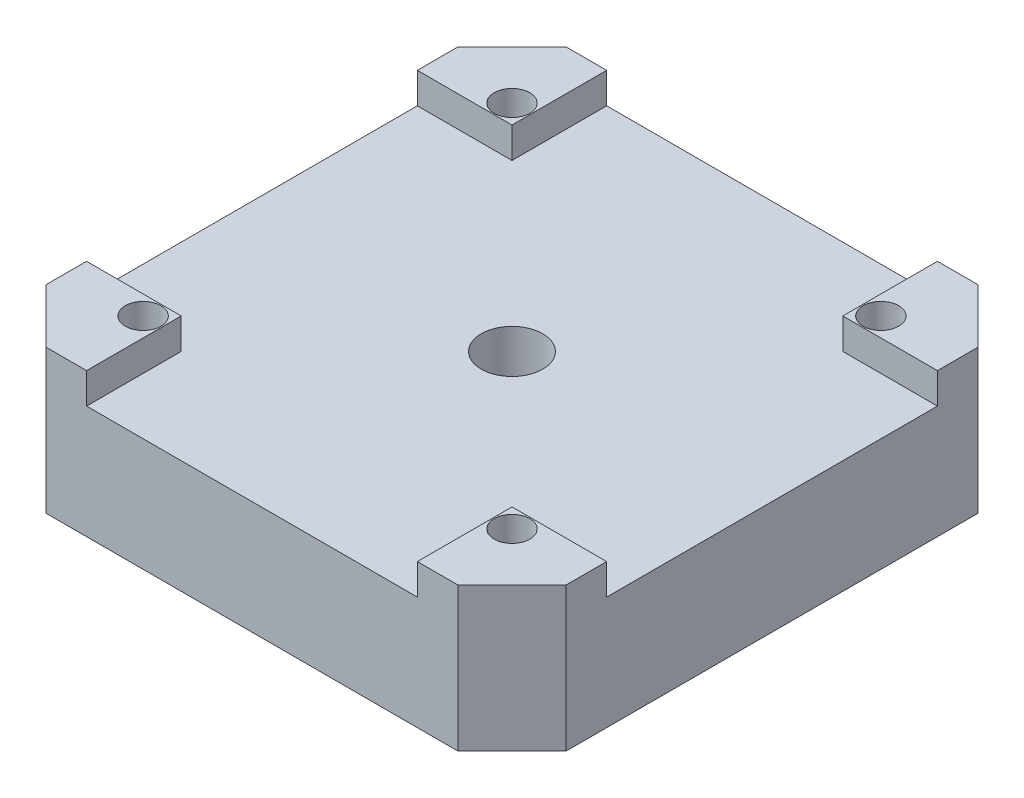
ISO-10303-21;
HEADER;
FILE_DESCRIPTION(('STEP AP214'),'2;1');
FILE_NAME('part.step','',(''),(''),'','','');
FILE_SCHEMA(('AUTOMOTIVE_DESIGN { 1 0 10303 214 1 1 1 1 }'));
ENDSEC;
DATA;
#1=APPLICATION_CONTEXT('core data for automotive mechanical design processes');
#2=APPLICATION_PROTOCOL_DEFINITION('international standard','automotive_design',2000,#1);
#3=PRODUCT_CONTEXT('',#1,'mechanical');
#4=PRODUCT('Part','Part','',(#3));
#5=PRODUCT_RELATED_PRODUCT_CATEGORY('part','',(#4));
#6=PRODUCT_DEFINITION_FORMATION('','',#4);
#7=PRODUCT_DEFINITION_CONTEXT('part definition',#1,'design');
#8=PRODUCT_DEFINITION('design','',#6,#7);
#9=PRODUCT_DEFINITION_SHAPE('','',#8);
#10=(LENGTH_UNIT() NAMED_UNIT(*) SI_UNIT(.MILLI.,.METRE.));
#11=(NAMED_UNIT(*) PLANE_ANGLE_UNIT() SI_UNIT($,.RADIAN.));
#12=(NAMED_UNIT(*) SI_UNIT($,.STERADIAN.) SOLID_ANGLE_UNIT());
#13=UNCERTAINTY_MEASURE_WITH_UNIT(LENGTH_MEASURE(1.E-05),#10,'distance_accuracy_value','');
#14=(GEOMETRIC_REPRESENTATION_CONTEXT(3) GLOBAL_UNCERTAINTY_ASSIGNED_CONTEXT((#13)) GLOBAL_UNIT_ASSIGNED_CONTEXT((#10,
#11,#12)) REPRESENTATION_CONTEXT('',''));
#15=CARTESIAN_POINT('',(0.,0.,0.));
#16=DIRECTION('',(0.,0.,1.));
#17=DIRECTION('',(1.,0.,0.));
#18=AXIS2_PLACEMENT_3D('',#15,#16,#17);
#19=CARTESIAN_POINT('',(0.,11.7,0.));
#20=DIRECTION('',(0.,-1.,0.));
#21=DIRECTION('',(0.,0.,-1.));
#22=AXIS2_PLACEMENT_3D('',#19,#20,#21);
#23=PLANE('',#22);
#24=CARTESIAN_POINT('',(15.,11.7,-15.));
#25=DIRECTION('',(0.,-1.,0.));
#26=DIRECTION('',(0.,0.,-1.));
#27=AXIS2_PLACEMENT_3D('',#24,#25,#26);
#28=CIRCLE('',#27,1.45);
#29=CARTESIAN_POINT('',(15.,11.7,-16.45));
#30=VERTEX_POINT('',#29);
#31=EDGE_CURVE('E371',#30,#30,#28,.T.);
#32=ORIENTED_EDGE('',*,*,#31,.T.);
#33=EDGE_LOOP('',(#32));
#34=FACE_BOUND('',#33,.T.);
#35=DIRECTION('',(-1.,0.,0.));
#36=VECTOR('',#35,1.);
#37=CARTESIAN_POINT('',(-16.750923471599,11.7,-21.15));
#38=LINE('',#37,#36);
#39=CARTESIAN_POINT('',(16.750923471599,11.7,-21.15));
#40=VERTEX_POINT('',#39);
#41=CARTESIAN_POINT('',(13.450923471599,11.7,-21.15));
#42=VERTEX_POINT('',#41);
#43=EDGE_CURVE('E193',#40,#42,#38,.T.);
#44=ORIENTED_EDGE('',*,*,#43,.T.);
#45=DIRECTION('',(0.,0.,1.));
#46=VECTOR('',#45,1.);
#47=CARTESIAN_POINT('',(13.450923471599,11.7,-21.15));
#48=LINE('',#47,#46);
#49=CARTESIAN_POINT('',(13.450923471599,11.7,-13.4509234715989));
#50=VERTEX_POINT('',#49);
#51=EDGE_CURVE('E303',#42,#50,#48,.T.);
#52=ORIENTED_EDGE('',*,*,#51,.T.);
#53=DIRECTION('',(1.,0.,0.));
#54=VECTOR('',#53,1.);
#55=CARTESIAN_POINT('',(-21.15,11.7,-13.4509234715989));
#56=LINE('',#55,#54);
#57=CARTESIAN_POINT('',(21.15,11.7,-13.4509234715989));
#58=VERTEX_POINT('',#57);
#59=EDGE_CURVE('E289',#50,#58,#56,.T.);
#60=ORIENTED_EDGE('',*,*,#59,.T.);
#61=DIRECTION('',(0.,0.,-1.));
#62=VECTOR('',#61,1.);
#63=CARTESIAN_POINT('',(21.15,11.7,16.7509234715989));
#64=LINE('',#63,#62);
#65=CARTESIAN_POINT('',(21.15,11.7,-16.7509234715989));
#66=VERTEX_POINT('',#65);
#67=EDGE_CURVE('E277',#58,#66,#64,.T.);
#68=ORIENTED_EDGE('',*,*,#67,.T.);
#69=DIRECTION('',(-0.707106781186542,0.,-0.707106781186553));
#70=VECTOR('',#69,1.);
#71=CARTESIAN_POINT('',(16.750923471599,11.7,-21.15));
#72=LINE('',#71,#70);
#73=EDGE_CURVE('E194',#66,#40,#72,.T.);
#74=ORIENTED_EDGE('',*,*,#73,.T.);
#75=EDGE_LOOP('',(#44,#52,#60,#68,#74));
#76=FACE_BOUND('',#75,.T.);
#77=ADVANCED_FACE('F34',(#34,#76),#23,.F.);
#78=CARTESIAN_POINT('',(15.,11.7,15.));
#79=DIRECTION('',(0.,-1.,0.));
#80=DIRECTION('',(0.,0.,-1.));
#81=AXIS2_PLACEMENT_3D('',#78,#79,#80);
#82=CIRCLE('',#81,1.45);
#83=CARTESIAN_POINT('',(15.,11.7,13.55));
#84=VERTEX_POINT('',#83);
#85=EDGE_CURVE('E385',#84,#84,#82,.T.);
#86=ORIENTED_EDGE('',*,*,#85,.T.);
#87=EDGE_LOOP('',(#86));
#88=FACE_BOUND('',#87,.T.);
#89=DIRECTION('',(1.,0.,0.));
#90=VECTOR('',#89,1.);
#91=CARTESIAN_POINT('',(-21.15,11.7,13.4509234715989));
#92=LINE('',#91,#90);
#93=CARTESIAN_POINT('',(13.450923471599,11.7,13.4509234715989));
#94=VERTEX_POINT('',#93);
#95=CARTESIAN_POINT('',(21.15,11.7,13.4509234715989));
#96=VERTEX_POINT('',#95);
#97=EDGE_CURVE('E267',#94,#96,#92,.T.);
#98=ORIENTED_EDGE('',*,*,#97,.F.);
#99=CARTESIAN_POINT('',(13.450923471599,11.7,21.15));
#100=VERTEX_POINT('',#99);
#101=EDGE_CURVE('E306',#94,#100,#48,.T.);
#102=ORIENTED_EDGE('',*,*,#101,.T.);
#103=DIRECTION('',(1.,0.,0.));
#104=VECTOR('',#103,1.);
#105=CARTESIAN_POINT('',(-16.750923471599,11.7,21.15));
#106=LINE('',#105,#104);
#107=CARTESIAN_POINT('',(16.750923471599,11.7,21.15));
#108=VERTEX_POINT('',#107);
#109=EDGE_CURVE('E272',#100,#108,#106,.T.);
#110=ORIENTED_EDGE('',*,*,#109,.T.);
#111=DIRECTION('',(0.707106781186546,0.,-0.707106781186549));
#112=VECTOR('',#111,1.);
#113=CARTESIAN_POINT('',(16.750923471599,11.7,21.15));
#114=LINE('',#113,#112);
#115=CARTESIAN_POINT('',(21.15,11.7,16.7509234715989));
#116=VERTEX_POINT('',#115);
#117=EDGE_CURVE('E276',#108,#116,#114,.T.);
#118=ORIENTED_EDGE('',*,*,#117,.T.);
#119=EDGE_CURVE('E199',#116,#96,#64,.T.);
#120=ORIENTED_EDGE('',*,*,#119,.T.);
#121=EDGE_LOOP('',(#98,#102,#110,#118,#120));
#122=FACE_BOUND('',#121,.T.);
#123=ADVANCED_FACE('F447',(#88,#122),#23,.F.);
#124=CARTESIAN_POINT('',(-21.15,9.2,-13.4509234715989));
#125=DIRECTION('',(0.,0.,-1.));
#126=DIRECTION('',(-1.,0.,0.));
#127=AXIS2_PLACEMENT_3D('',#124,#125,#126);
#128=PLANE('',#127);
#129=ORIENTED_EDGE('',*,*,#59,.F.);
#130=DIRECTION('',(0.,-1.,0.));
#131=VECTOR('',#130,1.);
#132=CARTESIAN_POINT('',(13.450923471599,9.20000000000002,-13.4509234715989));
#133=LINE('',#132,#131);
#134=CARTESIAN_POINT('',(13.450923471599,9.2,-13.4509234715989));
#135=VERTEX_POINT('',#134);
#136=EDGE_CURVE('E311',#50,#135,#133,.T.);
#137=ORIENTED_EDGE('',*,*,#136,.T.);
#138=DIRECTION('',(1.,0.,0.));
#139=VECTOR('',#138,1.);
#140=CARTESIAN_POINT('',(-21.15,9.2,-13.4509234715989));
#141=LINE('',#140,#139);
#142=CARTESIAN_POINT('',(21.15,9.2,-13.4509234715989));
#143=VERTEX_POINT('',#142);
#144=EDGE_CURVE('E259',#135,#143,#141,.T.);
#145=ORIENTED_EDGE('',*,*,#144,.T.);
#146=DIRECTION('',(0.,1.,0.));
#147=VECTOR('',#146,1.);
#148=CARTESIAN_POINT('',(21.15,9.2,-13.4509234715989));
#149=LINE('',#148,#147);
#150=EDGE_CURVE('E313',#143,#58,#149,.T.);
#151=ORIENTED_EDGE('',*,*,#150,.T.);
#152=EDGE_LOOP('',(#129,#137,#145,#151));
#153=FACE_BOUND('',#152,.T.);
#154=ADVANCED_FACE('F310',(#153),#128,.F.);
#155=CARTESIAN_POINT('',(-21.15,11.7,13.4509234715989));
#156=DIRECTION('',(0.,0.,1.));
#157=DIRECTION('',(1.,0.,0.));
#158=AXIS2_PLACEMENT_3D('',#155,#156,#157);
#159=PLANE('',#158);
#160=DIRECTION('',(1.,0.,0.));
#161=VECTOR('',#160,1.);
#162=CARTESIAN_POINT('',(-21.15,9.2,13.4509234715989));
#163=LINE('',#162,#161);
#164=CARTESIAN_POINT('',(13.450923471599,9.2,13.4509234715989));
#165=VERTEX_POINT('',#164);
#166=CARTESIAN_POINT('',(21.15,9.2,13.4509234715989));
#167=VERTEX_POINT('',#166);
#168=EDGE_CURVE('E260',#165,#167,#163,.T.);
#169=ORIENTED_EDGE('',*,*,#168,.F.);
#170=DIRECTION('',(0.,1.,0.));
#171=VECTOR('',#170,1.);
#172=CARTESIAN_POINT('',(13.450923471599,11.7,13.4509234715989));
#173=LINE('',#172,#171);
#174=EDGE_CURVE('E11',#165,#94,#173,.T.);
#175=ORIENTED_EDGE('',*,*,#174,.T.);
#176=ORIENTED_EDGE('',*,*,#97,.T.);
#177=DIRECTION('',(0.,-1.,0.));
#178=VECTOR('',#177,1.);
#179=CARTESIAN_POINT('',(21.15,11.7,13.4509234715989));
#180=LINE('',#179,#178);
#181=EDGE_CURVE('E322',#96,#167,#180,.T.);
#182=ORIENTED_EDGE('',*,*,#181,.T.);
#183=EDGE_LOOP('',(#169,#175,#176,#182));
#184=FACE_BOUND('',#183,.T.);
#185=ADVANCED_FACE('F457',(#184),#159,.F.);
#186=CARTESIAN_POINT('',(-15.,11.7,-15.));
#187=DIRECTION('',(0.,-1.,0.));
#188=DIRECTION('',(0.,0.,-1.));
#189=AXIS2_PLACEMENT_3D('',#186,#187,#188);
#190=CIRCLE('',#189,1.45);
#191=CARTESIAN_POINT('',(-15.,11.7,-16.45));
#192=VERTEX_POINT('',#191);
#193=EDGE_CURVE('E359',#192,#192,#190,.T.);
#194=ORIENTED_EDGE('',*,*,#193,.T.);
#195=EDGE_LOOP('',(#194));
#196=FACE_BOUND('',#195,.T.);
#197=CARTESIAN_POINT('',(-21.15,11.7,-13.4509234715989));
#198=VERTEX_POINT('',#197);
#199=CARTESIAN_POINT('',(-13.450923471599,11.7,-13.4509234715989));
#200=VERTEX_POINT('',#199);
#201=EDGE_CURVE('E186',#198,#200,#56,.T.);
#202=ORIENTED_EDGE('',*,*,#201,.T.);
#203=DIRECTION('',(0.,0.,1.));
#204=VECTOR('',#203,1.);
#205=CARTESIAN_POINT('',(-13.450923471599,11.7,-21.15));
#206=LINE('',#205,#204);
#207=CARTESIAN_POINT('',(-13.450923471599,11.7,-21.15));
#208=VERTEX_POINT('',#207);
#209=EDGE_CURVE('E49',#208,#200,#206,.T.);
#210=ORIENTED_EDGE('',*,*,#209,.F.);
#211=CARTESIAN_POINT('',(-16.750923471599,11.7,-21.15));
#212=VERTEX_POINT('',#211);
#213=EDGE_CURVE('E183',#208,#212,#38,.T.);
#214=ORIENTED_EDGE('',*,*,#213,.T.);
#215=DIRECTION('',(-0.707106781186546,0.,0.707106781186549));
#216=VECTOR('',#215,1.);
#217=CARTESIAN_POINT('',(-21.15,11.7,-16.7509234715989));
#218=LINE('',#217,#216);
#219=CARTESIAN_POINT('',(-21.15,11.7,-16.7509234715989));
#220=VERTEX_POINT('',#219);
#221=EDGE_CURVE('E198',#212,#220,#218,.T.);
#222=ORIENTED_EDGE('',*,*,#221,.T.);
#223=DIRECTION('',(0.,0.,1.));
#224=VECTOR('',#223,1.);
#225=CARTESIAN_POINT('',(-21.15,11.7,16.7509234715989));
#226=LINE('',#225,#224);
#227=EDGE_CURVE('E268',#220,#198,#226,.T.);
#228=ORIENTED_EDGE('',*,*,#227,.T.);
#229=EDGE_LOOP('',(#202,#210,#214,#222,#228));
#230=FACE_BOUND('',#229,.T.);
#231=ADVANCED_FACE('F182',(#196,#230),#23,.F.);
#232=CARTESIAN_POINT('',(-21.15,11.7,16.7509234715989));
#233=DIRECTION('',(1.,0.,0.));
#234=DIRECTION('',(0.,0.,-1.));
#235=AXIS2_PLACEMENT_3D('',#232,#233,#234);
#236=PLANE('',#235);
#237=DIRECTION('',(0.,0.,-1.));
#238=VECTOR('',#237,1.);
#239=CARTESIAN_POINT('',(-21.15,9.2,13.4509234715989));
#240=LINE('',#239,#238);
#241=CARTESIAN_POINT('',(-21.15,9.2,13.4509234715989));
#242=VERTEX_POINT('',#241);
#243=CARTESIAN_POINT('',(-21.15,9.2,-13.4509234715989));
#244=VERTEX_POINT('',#243);
#245=EDGE_CURVE('E257',#242,#244,#240,.T.);
#246=ORIENTED_EDGE('',*,*,#245,.T.);
#247=DIRECTION('',(0.,1.,0.));
#248=VECTOR('',#247,1.);
#249=CARTESIAN_POINT('',(-21.15,9.2,-13.4509234715989));
#250=LINE('',#249,#248);
#251=EDGE_CURVE('E325',#244,#198,#250,.T.);
#252=ORIENTED_EDGE('',*,*,#251,.T.);
#253=ORIENTED_EDGE('',*,*,#227,.F.);
#254=DIRECTION('',(0.,-1.,0.));
#255=VECTOR('',#254,1.);
#256=CARTESIAN_POINT('',(-21.15,11.7,-16.7509234715989));
#257=LINE('',#256,#255);
#258=CARTESIAN_POINT('',(-21.15,0.,-16.7509234715989));
#259=VERTEX_POINT('',#258);
#260=EDGE_CURVE('E204',#220,#259,#257,.T.);
#261=ORIENTED_EDGE('',*,*,#260,.T.);
#262=DIRECTION('',(0.,0.,1.));
#263=VECTOR('',#262,1.);
#264=CARTESIAN_POINT('',(-21.15,0.,16.7509234715989));
#265=LINE('',#264,#263);
#266=CARTESIAN_POINT('',(-21.15,0.,16.7509234715989));
#267=VERTEX_POINT('',#266);
#268=EDGE_CURVE('E205',#259,#267,#265,.T.);
#269=ORIENTED_EDGE('',*,*,#268,.T.);
#270=DIRECTION('',(0.,-1.,0.));
#271=VECTOR('',#270,1.);
#272=CARTESIAN_POINT('',(-21.15,11.7,16.7509234715989));
#273=LINE('',#272,#271);
#274=CARTESIAN_POINT('',(-21.15,11.7,16.7509234715989));
#275=VERTEX_POINT('',#274);
#276=EDGE_CURVE('E242',#275,#267,#273,.T.);
#277=ORIENTED_EDGE('',*,*,#276,.F.);
#278=CARTESIAN_POINT('',(-21.15,11.7,13.4509234715989));
#279=VERTEX_POINT('',#278);
#280=EDGE_CURVE('E223',#279,#275,#226,.T.);
#281=ORIENTED_EDGE('',*,*,#280,.F.);
#282=DIRECTION('',(0.,-1.,0.));
#283=VECTOR('',#282,1.);
#284=CARTESIAN_POINT('',(-21.15,11.7,13.4509234715989));
#285=LINE('',#284,#283);
#286=EDGE_CURVE('E317',#279,#242,#285,.T.);
#287=ORIENTED_EDGE('',*,*,#286,.T.);
#288=EDGE_LOOP('',(#246,#252,#253,#261,#269,#277,#281,#287));
#289=FACE_BOUND('',#288,.T.);
#290=ADVANCED_FACE('F36',(#289),#236,.F.);
#291=CARTESIAN_POINT('',(-21.15,11.7,16.7509234715989));
#292=DIRECTION('',(0.707106781186553,0.,-0.707106781186542));
#293=DIRECTION('',(-0.707106781186542,0.,-0.707106781186553));
#294=AXIS2_PLACEMENT_3D('',#291,#292,#293);
#295=PLANE('',#294);
#296=DIRECTION('',(0.707106781186542,0.,0.707106781186553));
#297=VECTOR('',#296,1.);
#298=CARTESIAN_POINT('',(-21.15,0.,16.7509234715989));
#299=LINE('',#298,#297);
#300=CARTESIAN_POINT('',(-16.750923471599,0.,21.15));
#301=VERTEX_POINT('',#300);
#302=EDGE_CURVE('E208',#267,#301,#299,.T.);
#303=ORIENTED_EDGE('',*,*,#302,.T.);
#304=DIRECTION('',(0.,-1.,0.));
#305=VECTOR('',#304,1.);
#306=CARTESIAN_POINT('',(-16.750923471599,11.7,21.15));
#307=LINE('',#306,#305);
#308=CARTESIAN_POINT('',(-16.750923471599,11.7,21.15));
#309=VERTEX_POINT('',#308);
#310=EDGE_CURVE('E239',#309,#301,#307,.T.);
#311=ORIENTED_EDGE('',*,*,#310,.F.);
#312=DIRECTION('',(0.707106781186542,0.,0.707106781186553));
#313=VECTOR('',#312,1.);
#314=CARTESIAN_POINT('',(-21.15,11.7,16.7509234715989));
#315=LINE('',#314,#313);
#316=EDGE_CURVE('E270',#275,#309,#315,.T.);
#317=ORIENTED_EDGE('',*,*,#316,.F.);
#318=ORIENTED_EDGE('',*,*,#276,.T.);
#319=EDGE_LOOP('',(#303,#311,#317,#318));
#320=FACE_BOUND('',#319,.T.);
#321=ADVANCED_FACE('F685',(#320),#295,.F.);
#322=CARTESIAN_POINT('',(-16.750923471599,11.7,21.15));
#323=DIRECTION('',(0.,0.,-1.));
#324=DIRECTION('',(-1.,0.,0.));
#325=AXIS2_PLACEMENT_3D('',#322,#323,#324);
#326=PLANE('',#325);
#327=ORIENTED_EDGE('',*,*,#109,.F.);
#328=DIRECTION('',(0.,1.,0.));
#329=VECTOR('',#328,1.);
#330=CARTESIAN_POINT('',(13.450923471599,9.2,21.15));
#331=LINE('',#330,#329);
#332=CARTESIAN_POINT('',(13.450923471599,9.2,21.15));
#333=VERTEX_POINT('',#332);
#334=EDGE_CURVE('E178',#333,#100,#331,.T.);
#335=ORIENTED_EDGE('',*,*,#334,.F.);
#336=DIRECTION('',(1.,0.,0.));
#337=VECTOR('',#336,1.);
#338=CARTESIAN_POINT('',(-13.450923471599,9.2,21.15));
#339=LINE('',#338,#337);
#340=CARTESIAN_POINT('',(-13.450923471599,9.2,21.15));
#341=VERTEX_POINT('',#340);
#342=EDGE_CURVE('E337',#341,#333,#339,.T.);
#343=ORIENTED_EDGE('',*,*,#342,.F.);
#344=DIRECTION('',(0.,-1.,0.));
#345=VECTOR('',#344,1.);
#346=CARTESIAN_POINT('',(-13.450923471599,11.7,21.15));
#347=LINE('',#346,#345);
#348=CARTESIAN_POINT('',(-13.450923471599,11.7,21.15));
#349=VERTEX_POINT('',#348);
#350=EDGE_CURVE('E339',#349,#341,#347,.T.);
#351=ORIENTED_EDGE('',*,*,#350,.F.);
#352=EDGE_CURVE('E273',#309,#349,#106,.T.);
#353=ORIENTED_EDGE('',*,*,#352,.F.);
#354=ORIENTED_EDGE('',*,*,#310,.T.);
#355=DIRECTION('',(1.,0.,0.));
#356=VECTOR('',#355,1.);
#357=CARTESIAN_POINT('',(-16.750923471599,0.,21.15));
#358=LINE('',#357,#356);
#359=CARTESIAN_POINT('',(16.750923471599,0.,21.15));
#360=VERTEX_POINT('',#359);
#361=EDGE_CURVE('E210',#301,#360,#358,.T.);
#362=ORIENTED_EDGE('',*,*,#361,.T.);
#363=DIRECTION('',(0.,-1.,0.));
#364=VECTOR('',#363,1.);
#365=CARTESIAN_POINT('',(16.750923471599,11.7,21.15));
#366=LINE('',#365,#364);
#367=EDGE_CURVE('E236',#108,#360,#366,.T.);
#368=ORIENTED_EDGE('',*,*,#367,.F.);
#369=EDGE_LOOP('',(#327,#335,#343,#351,#353,#354,#362,#368));
#370=FACE_BOUND('',#369,.T.);
#371=ADVANCED_FACE('F691',(#370),#326,.F.);
#372=CARTESIAN_POINT('',(16.750923471599,11.7,21.15));
#373=DIRECTION('',(-0.707106781186549,0.,-0.707106781186546));
#374=DIRECTION('',(-0.707106781186546,0.,0.707106781186549));
#375=AXIS2_PLACEMENT_3D('',#372,#373,#374);
#376=PLANE('',#375);
#377=DIRECTION('',(0.707106781186546,0.,-0.707106781186549));
#378=VECTOR('',#377,1.);
#379=CARTESIAN_POINT('',(16.750923471599,0.,21.15));
#380=LINE('',#379,#378);
#381=CARTESIAN_POINT('',(21.15,0.,16.7509234715989));
#382=VERTEX_POINT('',#381);
#383=EDGE_CURVE('E213',#360,#382,#380,.T.);
#384=ORIENTED_EDGE('',*,*,#383,.T.);
#385=DIRECTION('',(0.,-1.,0.));
#386=VECTOR('',#385,1.);
#387=CARTESIAN_POINT('',(21.15,11.7,16.7509234715989));
#388=LINE('',#387,#386);
#389=EDGE_CURVE('E233',#116,#382,#388,.T.);
#390=ORIENTED_EDGE('',*,*,#389,.F.);
#391=ORIENTED_EDGE('',*,*,#117,.F.);
#392=ORIENTED_EDGE('',*,*,#367,.T.);
#393=EDGE_LOOP('',(#384,#390,#391,#392));
#394=FACE_BOUND('',#393,.T.);
#395=ADVANCED_FACE('F698',(#394),#376,.F.);
#396=CARTESIAN_POINT('',(21.15,11.7,16.7509234715989));
#397=DIRECTION('',(-1.,0.,0.));
#398=DIRECTION('',(0.,0.,1.));
#399=AXIS2_PLACEMENT_3D('',#396,#397,#398);
#400=PLANE('',#399);
#401=ORIENTED_EDGE('',*,*,#67,.F.);
#402=ORIENTED_EDGE('',*,*,#150,.F.);
#403=DIRECTION('',(0.,0.,-1.));
#404=VECTOR('',#403,1.);
#405=CARTESIAN_POINT('',(21.15,9.2,13.4509234715989));
#406=LINE('',#405,#404);
#407=EDGE_CURVE('E318',#167,#143,#406,.T.);
#408=ORIENTED_EDGE('',*,*,#407,.F.);
#409=ORIENTED_EDGE('',*,*,#181,.F.);
#410=ORIENTED_EDGE('',*,*,#119,.F.);
#411=ORIENTED_EDGE('',*,*,#389,.T.);
#412=DIRECTION('',(0.,0.,-1.));
#413=VECTOR('',#412,1.);
#414=CARTESIAN_POINT('',(21.15,0.,16.7509234715989));
#415=LINE('',#414,#413);
#416=CARTESIAN_POINT('',(21.15,0.,-16.7509234715989));
#417=VERTEX_POINT('',#416);
#418=EDGE_CURVE('E215',#382,#417,#415,.T.);
#419=ORIENTED_EDGE('',*,*,#418,.T.);
#420=DIRECTION('',(0.,-1.,0.));
#421=VECTOR('',#420,1.);
#422=CARTESIAN_POINT('',(21.15,11.7,-16.7509234715989));
#423=LINE('',#422,#421);
#424=EDGE_CURVE('E230',#66,#417,#423,.T.);
#425=ORIENTED_EDGE('',*,*,#424,.F.);
#426=EDGE_LOOP('',(#401,#402,#408,#409,#410,#411,#419,#425));
#427=FACE_BOUND('',#426,.T.);
#428=ADVANCED_FACE('F293',(#427),#400,.F.);
#429=CARTESIAN_POINT('',(16.750923471599,11.7,-21.15));
#430=DIRECTION('',(-0.707106781186553,0.,0.707106781186542));
#431=DIRECTION('',(0.707106781186542,0.,0.707106781186553));
#432=AXIS2_PLACEMENT_3D('',#429,#430,#431);
#433=PLANE('',#432);
#434=DIRECTION('',(-0.707106781186542,0.,-0.707106781186553));
#435=VECTOR('',#434,1.);
#436=CARTESIAN_POINT('',(16.750923471599,0.,-21.15));
#437=LINE('',#436,#435);
#438=CARTESIAN_POINT('',(16.750923471599,0.,-21.15));
#439=VERTEX_POINT('',#438);
#440=EDGE_CURVE('E217',#417,#439,#437,.T.);
#441=ORIENTED_EDGE('',*,*,#440,.T.);
#442=DIRECTION('',(0.,-1.,0.));
#443=VECTOR('',#442,1.);
#444=CARTESIAN_POINT('',(16.750923471599,11.7,-21.15));
#445=LINE('',#444,#443);
#446=EDGE_CURVE('E227',#40,#439,#445,.T.);
#447=ORIENTED_EDGE('',*,*,#446,.F.);
#448=ORIENTED_EDGE('',*,*,#73,.F.);
#449=ORIENTED_EDGE('',*,*,#424,.T.);
#450=EDGE_LOOP('',(#441,#447,#448,#449));
#451=FACE_BOUND('',#450,.T.);
#452=ADVANCED_FACE('F297',(#451),#433,.F.);
#453=CARTESIAN_POINT('',(-16.750923471599,11.7,-21.15));
#454=DIRECTION('',(0.,0.,1.));
#455=DIRECTION('',(1.,0.,0.));
#456=AXIS2_PLACEMENT_3D('',#453,#454,#455);
#457=PLANE('',#456);
#458=DIRECTION('',(1.,0.,0.));
#459=VECTOR('',#458,1.);
#460=CARTESIAN_POINT('',(-13.450923471599,9.2,-21.15));
#461=LINE('',#460,#459);
#462=CARTESIAN_POINT('',(-13.450923471599,9.2,-21.15));
#463=VERTEX_POINT('',#462);
#464=CARTESIAN_POINT('',(13.450923471599,9.2,-21.15));
#465=VERTEX_POINT('',#464);
#466=EDGE_CURVE('E177',#463,#465,#461,.T.);
#467=ORIENTED_EDGE('',*,*,#466,.T.);
#468=DIRECTION('',(0.,1.,0.));
#469=VECTOR('',#468,1.);
#470=CARTESIAN_POINT('',(13.450923471599,9.2,-21.15));
#471=LINE('',#470,#469);
#472=EDGE_CURVE('E302',#465,#42,#471,.T.);
#473=ORIENTED_EDGE('',*,*,#472,.T.);
#474=ORIENTED_EDGE('',*,*,#43,.F.);
#475=ORIENTED_EDGE('',*,*,#446,.T.);
#476=DIRECTION('',(-1.,0.,0.));
#477=VECTOR('',#476,1.);
#478=CARTESIAN_POINT('',(-16.750923471599,0.,-21.15));
#479=LINE('',#478,#477);
#480=CARTESIAN_POINT('',(-16.750923471599,0.,-21.15));
#481=VERTEX_POINT('',#480);
#482=EDGE_CURVE('E219',#439,#481,#479,.T.);
#483=ORIENTED_EDGE('',*,*,#482,.T.);
#484=DIRECTION('',(0.,-1.,0.));
#485=VECTOR('',#484,1.);
#486=CARTESIAN_POINT('',(-16.750923471599,11.7,-21.15));
#487=LINE('',#486,#485);
#488=EDGE_CURVE('E191',#212,#481,#487,.T.);
#489=ORIENTED_EDGE('',*,*,#488,.F.);
#490=ORIENTED_EDGE('',*,*,#213,.F.);
#491=DIRECTION('',(0.,-1.,0.));
#492=VECTOR('',#491,1.);
#493=CARTESIAN_POINT('',(-13.450923471599,11.7,-21.15));
#494=LINE('',#493,#492);
#495=EDGE_CURVE('E169',#208,#463,#494,.T.);
#496=ORIENTED_EDGE('',*,*,#495,.T.);
#497=EDGE_LOOP('',(#467,#473,#474,#475,#483,#489,#490,#496));
#498=FACE_BOUND('',#497,.T.);
#499=ADVANCED_FACE('F189',(#498),#457,.F.);
#500=CARTESIAN_POINT('',(-21.15,11.7,-16.7509234715989));
#501=DIRECTION('',(0.707106781186549,0.,0.707106781186546));
#502=DIRECTION('',(0.707106781186546,0.,-0.707106781186549));
#503=AXIS2_PLACEMENT_3D('',#500,#501,#502);
#504=PLANE('',#503);
#505=DIRECTION('',(-0.707106781186546,0.,0.707106781186549));
#506=VECTOR('',#505,1.);
#507=CARTESIAN_POINT('',(-21.15,0.,-16.7509234715989));
#508=LINE('',#507,#506);
#509=EDGE_CURVE('E221',#481,#259,#508,.T.);
#510=ORIENTED_EDGE('',*,*,#509,.T.);
#511=ORIENTED_EDGE('',*,*,#260,.F.);
#512=ORIENTED_EDGE('',*,*,#221,.F.);
#513=ORIENTED_EDGE('',*,*,#488,.T.);
#514=EDGE_LOOP('',(#510,#511,#512,#513));
#515=FACE_BOUND('',#514,.T.);
#516=ADVANCED_FACE('F436',(#515),#504,.F.);
#517=CARTESIAN_POINT('',(-15.,11.7,15.));
#518=DIRECTION('',(0.,-1.,0.));
#519=DIRECTION('',(0.,0.,-1.));
#520=AXIS2_PLACEMENT_3D('',#517,#518,#519);
#521=CIRCLE('',#520,1.45);
#522=CARTESIAN_POINT('',(-15.,11.7,13.55));
#523=VERTEX_POINT('',#522);
#524=EDGE_CURVE('E397',#523,#523,#521,.T.);
#525=ORIENTED_EDGE('',*,*,#524,.T.);
#526=EDGE_LOOP('',(#525));
#527=FACE_BOUND('',#526,.T.);
#528=ORIENTED_EDGE('',*,*,#352,.T.);
#529=CARTESIAN_POINT('',(-13.450923471599,11.7,13.4509234715989));
#530=VERTEX_POINT('',#529);
#531=EDGE_CURVE('E187',#530,#349,#206,.T.);
#532=ORIENTED_EDGE('',*,*,#531,.F.);
#533=EDGE_CURVE('E251',#279,#530,#92,.T.);
#534=ORIENTED_EDGE('',*,*,#533,.F.);
#535=ORIENTED_EDGE('',*,*,#280,.T.);
#536=ORIENTED_EDGE('',*,*,#316,.T.);
#537=EDGE_LOOP('',(#528,#532,#534,#535,#536));
#538=FACE_BOUND('',#537,.T.);
#539=ADVANCED_FACE('F417',(#527,#538),#23,.F.);
#540=CARTESIAN_POINT('',(0.,0.,0.));
#541=DIRECTION('',(0.,-1.,0.));
#542=DIRECTION('',(0.,0.,-1.));
#543=AXIS2_PLACEMENT_3D('',#540,#541,#542);
#544=PLANE('',#543);
#545=CARTESIAN_POINT('',(-15.,0.,15.));
#546=DIRECTION('',(0.,-1.,0.));
#547=DIRECTION('',(0.,0.,-1.));
#548=AXIS2_PLACEMENT_3D('',#545,#546,#547);
#549=CIRCLE('',#548,3.);
#550=CARTESIAN_POINT('',(-15.,0.,12.));
#551=VERTEX_POINT('',#550);
#552=EDGE_CURVE('E407',#551,#551,#549,.T.);
#553=ORIENTED_EDGE('',*,*,#552,.F.);
#554=EDGE_LOOP('',(#553));
#555=FACE_BOUND('',#554,.T.);
#556=CARTESIAN_POINT('',(15.,0.,15.));
#557=DIRECTION('',(0.,-1.,0.));
#558=DIRECTION('',(0.,0.,-1.));
#559=AXIS2_PLACEMENT_3D('',#556,#557,#558);
#560=CIRCLE('',#559,3.);
#561=CARTESIAN_POINT('',(15.,0.,12.));
#562=VERTEX_POINT('',#561);
#563=EDGE_CURVE('E394',#562,#562,#560,.T.);
#564=ORIENTED_EDGE('',*,*,#563,.F.);
#565=EDGE_LOOP('',(#564));
#566=FACE_BOUND('',#565,.T.);
#567=CARTESIAN_POINT('',(15.,0.,-15.));
#568=DIRECTION('',(0.,-1.,0.));
#569=DIRECTION('',(0.,0.,-1.));
#570=AXIS2_PLACEMENT_3D('',#567,#568,#569);
#571=CIRCLE('',#570,3.);
#572=CARTESIAN_POINT('',(15.,0.,-18.));
#573=VERTEX_POINT('',#572);
#574=EDGE_CURVE('E382',#573,#573,#571,.T.);
#575=ORIENTED_EDGE('',*,*,#574,.F.);
#576=EDGE_LOOP('',(#575));
#577=FACE_BOUND('',#576,.T.);
#578=CARTESIAN_POINT('',(-15.,0.,-15.));
#579=DIRECTION('',(0.,-1.,0.));
#580=DIRECTION('',(0.,0.,-1.));
#581=AXIS2_PLACEMENT_3D('',#578,#579,#580);
#582=CIRCLE('',#581,3.);
#583=CARTESIAN_POINT('',(-15.,0.,-18.));
#584=VERTEX_POINT('',#583);
#585=EDGE_CURVE('E368',#584,#584,#582,.T.);
#586=ORIENTED_EDGE('',*,*,#585,.F.);
#587=EDGE_LOOP('',(#586));
#588=FACE_BOUND('',#587,.T.);
#589=CARTESIAN_POINT('',(0.,0.,0.));
#590=DIRECTION('',(0.,-1.,0.));
#591=DIRECTION('',(0.,0.,-1.));
#592=AXIS2_PLACEMENT_3D('',#589,#590,#591);
#593=CIRCLE('',#592,3.25);
#594=CARTESIAN_POINT('',(0.,0.,-3.25));
#595=VERTEX_POINT('',#594);
#596=EDGE_CURVE('E344',#595,#595,#593,.T.);
#597=ORIENTED_EDGE('',*,*,#596,.F.);
#598=EDGE_LOOP('',(#597));
#599=FACE_BOUND('',#598,.T.);
#600=ORIENTED_EDGE('',*,*,#268,.F.);
#601=ORIENTED_EDGE('',*,*,#509,.F.);
#602=ORIENTED_EDGE('',*,*,#482,.F.);
#603=ORIENTED_EDGE('',*,*,#440,.F.);
#604=ORIENTED_EDGE('',*,*,#418,.F.);
#605=ORIENTED_EDGE('',*,*,#383,.F.);
#606=ORIENTED_EDGE('',*,*,#361,.F.);
#607=ORIENTED_EDGE('',*,*,#302,.F.);
#608=EDGE_LOOP('',(#600,#601,#602,#603,#604,#605,#606,#607));
#609=FACE_BOUND('',#608,.T.);
#610=ADVANCED_FACE('F413',(#555,#566,#577,#588,#599,#609),#544,.T.);
#611=CARTESIAN_POINT('',(-13.450923471599,9.2,-13.4509234715989));
#612=VERTEX_POINT('',#611);
#613=EDGE_CURVE('E262',#244,#612,#141,.T.);
#614=ORIENTED_EDGE('',*,*,#613,.T.);
#615=DIRECTION('',(0.,1.,0.));
#616=VECTOR('',#615,1.);
#617=CARTESIAN_POINT('',(-13.450923471599,9.2,-13.4509234715989));
#618=LINE('',#617,#616);
#619=EDGE_CURVE('E305',#612,#200,#618,.T.);
#620=ORIENTED_EDGE('',*,*,#619,.T.);
#621=ORIENTED_EDGE('',*,*,#201,.F.);
#622=ORIENTED_EDGE('',*,*,#251,.F.);
#623=EDGE_LOOP('',(#614,#620,#621,#622));
#624=FACE_BOUND('',#623,.T.);
#625=ADVANCED_FACE('F416',(#624),#128,.F.);
#626=CARTESIAN_POINT('',(-21.15,9.2,13.4509234715989));
#627=DIRECTION('',(0.,-1.,0.));
#628=DIRECTION('',(0.,0.,-1.));
#629=AXIS2_PLACEMENT_3D('',#626,#627,#628);
#630=PLANE('',#629);
#631=CARTESIAN_POINT('',(0.,9.2,0.));
#632=DIRECTION('',(0.,-1.,0.));
#633=DIRECTION('',(0.,0.,-1.));
#634=AXIS2_PLACEMENT_3D('',#631,#632,#633);
#635=CIRCLE('',#634,2.5);
#636=CARTESIAN_POINT('',(0.,9.2,-2.5));
#637=VERTEX_POINT('',#636);
#638=EDGE_CURVE('E348',#637,#637,#635,.T.);
#639=ORIENTED_EDGE('',*,*,#638,.T.);
#640=EDGE_LOOP('',(#639));
#641=FACE_BOUND('',#640,.T.);
#642=CARTESIAN_POINT('',(-13.450923471599,9.2,13.4509234715989));
#643=VERTEX_POINT('',#642);
#644=EDGE_CURVE('E248',#242,#643,#163,.T.);
#645=ORIENTED_EDGE('',*,*,#644,.T.);
#646=DIRECTION('',(0.,0.,1.));
#647=VECTOR('',#646,1.);
#648=CARTESIAN_POINT('',(-13.450923471599,9.2,-21.15));
#649=LINE('',#648,#647);
#650=EDGE_CURVE('E57',#643,#341,#649,.T.);
#651=ORIENTED_EDGE('',*,*,#650,.T.);
#652=ORIENTED_EDGE('',*,*,#342,.T.);
#653=DIRECTION('',(0.,0.,1.));
#654=VECTOR('',#653,1.);
#655=CARTESIAN_POINT('',(13.450923471599,9.2,-21.15));
#656=LINE('',#655,#654);
#657=EDGE_CURVE('E333',#165,#333,#656,.T.);
#658=ORIENTED_EDGE('',*,*,#657,.F.);
#659=ORIENTED_EDGE('',*,*,#168,.T.);
#660=ORIENTED_EDGE('',*,*,#407,.T.);
#661=ORIENTED_EDGE('',*,*,#144,.F.);
#662=EDGE_CURVE('E334',#465,#135,#656,.T.);
#663=ORIENTED_EDGE('',*,*,#662,.F.);
#664=ORIENTED_EDGE('',*,*,#466,.F.);
#665=EDGE_CURVE('E172',#463,#612,#649,.T.);
#666=ORIENTED_EDGE('',*,*,#665,.T.);
#667=ORIENTED_EDGE('',*,*,#613,.F.);
#668=ORIENTED_EDGE('',*,*,#245,.F.);
#669=EDGE_LOOP('',(#645,#651,#652,#658,#659,#660,#661,#663,#664,#666,#667,#668));
#670=FACE_BOUND('',#669,.T.);
#671=ADVANCED_FACE('F254',(#641,#670),#630,.F.);
#672=ORIENTED_EDGE('',*,*,#533,.T.);
#673=DIRECTION('',(0.,-1.,0.));
#674=VECTOR('',#673,1.);
#675=CARTESIAN_POINT('',(-13.450923471599,11.7,13.4509234715989));
#676=LINE('',#675,#674);
#677=EDGE_CURVE('E42',#530,#643,#676,.T.);
#678=ORIENTED_EDGE('',*,*,#677,.T.);
#679=ORIENTED_EDGE('',*,*,#644,.F.);
#680=ORIENTED_EDGE('',*,*,#286,.F.);
#681=EDGE_LOOP('',(#672,#678,#679,#680));
#682=FACE_BOUND('',#681,.T.);
#683=ADVANCED_FACE('F247',(#682),#159,.F.);
#684=CARTESIAN_POINT('',(-13.450923471599,11.7,-21.15));
#685=DIRECTION('',(-1.,0.,0.));
#686=DIRECTION('',(0.,0.,1.));
#687=AXIS2_PLACEMENT_3D('',#684,#685,#686);
#688=PLANE('',#687);
#689=ORIENTED_EDGE('',*,*,#531,.T.);
#690=ORIENTED_EDGE('',*,*,#350,.T.);
#691=ORIENTED_EDGE('',*,*,#650,.F.);
#692=ORIENTED_EDGE('',*,*,#677,.F.);
#693=EDGE_LOOP('',(#689,#690,#691,#692));
#694=FACE_BOUND('',#693,.T.);
#695=ADVANCED_FACE('F456',(#694),#688,.F.);
#696=CARTESIAN_POINT('',(13.450923471599,9.2,-21.15));
#697=DIRECTION('',(1.,0.,0.));
#698=DIRECTION('',(0.,1.,0.));
#699=AXIS2_PLACEMENT_3D('',#696,#697,#698);
#700=PLANE('',#699);
#701=ORIENTED_EDGE('',*,*,#657,.T.);
#702=ORIENTED_EDGE('',*,*,#334,.T.);
#703=ORIENTED_EDGE('',*,*,#101,.F.);
#704=ORIENTED_EDGE('',*,*,#174,.F.);
#705=EDGE_LOOP('',(#701,#702,#703,#704));
#706=FACE_BOUND('',#705,.T.);
#707=ADVANCED_FACE('F470',(#706),#700,.F.);
#708=ORIENTED_EDGE('',*,*,#51,.F.);
#709=ORIENTED_EDGE('',*,*,#472,.F.);
#710=ORIENTED_EDGE('',*,*,#662,.T.);
#711=ORIENTED_EDGE('',*,*,#136,.F.);
#712=EDGE_LOOP('',(#708,#709,#710,#711));
#713=FACE_BOUND('',#712,.T.);
#714=ADVANCED_FACE('F467',(#713),#700,.F.);
#715=ORIENTED_EDGE('',*,*,#665,.F.);
#716=ORIENTED_EDGE('',*,*,#495,.F.);
#717=ORIENTED_EDGE('',*,*,#209,.T.);
#718=ORIENTED_EDGE('',*,*,#619,.F.);
#719=EDGE_LOOP('',(#715,#716,#717,#718));
#720=FACE_BOUND('',#719,.T.);
#721=ADVANCED_FACE('F170',(#720),#688,.F.);
#722=CARTESIAN_POINT('',(0.,3.,0.));
#723=DIRECTION('',(0.,-1.,0.));
#724=DIRECTION('',(0.,0.,-1.));
#725=AXIS2_PLACEMENT_3D('',#722,#723,#724);
#726=CYLINDRICAL_SURFACE('',#725,3.25);
#727=CARTESIAN_POINT('',(0.,3.,0.));
#728=DIRECTION('',(0.,-1.,0.));
#729=DIRECTION('',(0.,0.,-1.));
#730=AXIS2_PLACEMENT_3D('',#727,#728,#729);
#731=CIRCLE('',#730,3.25);
#732=CARTESIAN_POINT('',(0.,3.,-3.25));
#733=VERTEX_POINT('',#732);
#734=EDGE_CURVE('E341',#733,#733,#731,.T.);
#735=ORIENTED_EDGE('',*,*,#734,.F.);
#736=EDGE_LOOP('',(#735));
#737=FACE_BOUND('',#736,.T.);
#738=ORIENTED_EDGE('',*,*,#596,.T.);
#739=EDGE_LOOP('',(#738));
#740=FACE_BOUND('',#739,.T.);
#741=ADVANCED_FACE('F466',(#737,#740),#726,.F.);
#742=CARTESIAN_POINT('',(0.,3.,0.));
#743=DIRECTION('',(0.,-1.,0.));
#744=DIRECTION('',(0.,0.,-1.));
#745=AXIS2_PLACEMENT_3D('',#742,#743,#744);
#746=PLANE('',#745);
#747=CARTESIAN_POINT('',(0.,3.,0.));
#748=DIRECTION('',(0.,-1.,0.));
#749=DIRECTION('',(0.,0.,-1.));
#750=AXIS2_PLACEMENT_3D('',#747,#748,#749);
#751=CIRCLE('',#750,2.5);
#752=CARTESIAN_POINT('',(0.,3.,-2.5));
#753=VERTEX_POINT('',#752);
#754=EDGE_CURVE('E355',#753,#753,#751,.T.);
#755=ORIENTED_EDGE('',*,*,#754,.F.);
#756=EDGE_LOOP('',(#755));
#757=FACE_BOUND('',#756,.T.);
#758=ORIENTED_EDGE('',*,*,#734,.T.);
#759=EDGE_LOOP('',(#758));
#760=FACE_BOUND('',#759,.T.);
#761=ADVANCED_FACE('F473',(#757,#760),#746,.T.);
#762=CARTESIAN_POINT('',(0.,11.7,0.));
#763=DIRECTION('',(0.,-1.,0.));
#764=DIRECTION('',(0.,0.,-1.));
#765=AXIS2_PLACEMENT_3D('',#762,#763,#764);
#766=CYLINDRICAL_SURFACE('',#765,2.5);
#767=ORIENTED_EDGE('',*,*,#754,.T.);
#768=EDGE_LOOP('',(#767));
#769=FACE_BOUND('',#768,.T.);
#770=ORIENTED_EDGE('',*,*,#638,.F.);
#771=EDGE_LOOP('',(#770));
#772=FACE_BOUND('',#771,.T.);
#773=ADVANCED_FACE('F477',(#769,#772),#766,.F.);
#774=CARTESIAN_POINT('',(-15.,0.,-15.));
#775=DIRECTION('',(0.,-1.,0.));
#776=DIRECTION('',(0.,0.,-1.));
#777=AXIS2_PLACEMENT_3D('',#774,#775,#776);
#778=CYLINDRICAL_SURFACE('',#777,1.45);
#779=ORIENTED_EDGE('',*,*,#193,.F.);
#780=EDGE_LOOP('',(#779));
#781=FACE_BOUND('',#780,.T.);
#782=CARTESIAN_POINT('',(-15.,2.1,-15.));
#783=DIRECTION('',(0.,-1.,0.));
#784=DIRECTION('',(0.,0.,-1.));
#785=AXIS2_PLACEMENT_3D('',#782,#783,#784);
#786=CIRCLE('',#785,1.45);
#787=CARTESIAN_POINT('',(-15.,2.1,-16.45));
#788=VERTEX_POINT('',#787);
#789=EDGE_CURVE('E362',#788,#788,#786,.T.);
#790=ORIENTED_EDGE('',*,*,#789,.T.);
#791=EDGE_LOOP('',(#790));
#792=FACE_BOUND('',#791,.T.);
#793=ADVANCED_FACE('F481',(#781,#792),#778,.F.);
#794=CARTESIAN_POINT('',(-13.55,2.1,-15.));
#795=DIRECTION('',(0.,1.,0.));
#796=DIRECTION('',(0.,0.,1.));
#797=AXIS2_PLACEMENT_3D('',#794,#795,#796);
#798=PLANE('',#797);
#799=ORIENTED_EDGE('',*,*,#789,.F.);
#800=EDGE_LOOP('',(#799));
#801=FACE_BOUND('',#800,.T.);
#802=CARTESIAN_POINT('',(-15.,2.1,-15.));
#803=DIRECTION('',(0.,-1.,0.));
#804=DIRECTION('',(0.,0.,-1.));
#805=AXIS2_PLACEMENT_3D('',#802,#803,#804);
#806=CIRCLE('',#805,3.);
#807=CARTESIAN_POINT('',(-15.,2.1,-18.));
#808=VERTEX_POINT('',#807);
#809=EDGE_CURVE('E365',#808,#808,#806,.T.);
#810=ORIENTED_EDGE('',*,*,#809,.T.);
#811=EDGE_LOOP('',(#810));
#812=FACE_BOUND('',#811,.T.);
#813=ADVANCED_FACE('F485',(#801,#812),#798,.F.);
#814=CARTESIAN_POINT('',(-15.,0.,-15.));
#815=DIRECTION('',(0.,-1.,0.));
#816=DIRECTION('',(0.,0.,-1.));
#817=AXIS2_PLACEMENT_3D('',#814,#815,#816);
#818=CYLINDRICAL_SURFACE('',#817,3.);
#819=ORIENTED_EDGE('',*,*,#809,.F.);
#820=EDGE_LOOP('',(#819));
#821=FACE_BOUND('',#820,.T.);
#822=ORIENTED_EDGE('',*,*,#585,.T.);
#823=EDGE_LOOP('',(#822));
#824=FACE_BOUND('',#823,.T.);
#825=ADVANCED_FACE('F489',(#821,#824),#818,.F.);
#826=CARTESIAN_POINT('',(15.,0.,-15.));
#827=DIRECTION('',(0.,-1.,0.));
#828=DIRECTION('',(0.,0.,-1.));
#829=AXIS2_PLACEMENT_3D('',#826,#827,#828);
#830=CYLINDRICAL_SURFACE('',#829,1.45);
#831=ORIENTED_EDGE('',*,*,#31,.F.);
#832=EDGE_LOOP('',(#831));
#833=FACE_BOUND('',#832,.T.);
#834=CARTESIAN_POINT('',(15.,2.1,-15.));
#835=DIRECTION('',(0.,-1.,0.));
#836=DIRECTION('',(0.,0.,-1.));
#837=AXIS2_PLACEMENT_3D('',#834,#835,#836);
#838=CIRCLE('',#837,1.45);
#839=CARTESIAN_POINT('',(15.,2.1,-16.45));
#840=VERTEX_POINT('',#839);
#841=EDGE_CURVE('E374',#840,#840,#838,.T.);
#842=ORIENTED_EDGE('',*,*,#841,.T.);
#843=EDGE_LOOP('',(#842));
#844=FACE_BOUND('',#843,.T.);
#845=ADVANCED_FACE('F493',(#833,#844),#830,.F.);
#846=CARTESIAN_POINT('',(16.45,2.1,-15.));
#847=DIRECTION('',(0.,1.,0.));
#848=DIRECTION('',(0.,0.,1.));
#849=AXIS2_PLACEMENT_3D('',#846,#847,#848);
#850=PLANE('',#849);
#851=ORIENTED_EDGE('',*,*,#841,.F.);
#852=EDGE_LOOP('',(#851));
#853=FACE_BOUND('',#852,.T.);
#854=CARTESIAN_POINT('',(15.,2.1,-15.));
#855=DIRECTION('',(0.,-1.,0.));
#856=DIRECTION('',(0.,0.,-1.));
#857=AXIS2_PLACEMENT_3D('',#854,#855,#856);
#858=CIRCLE('',#857,3.);
#859=CARTESIAN_POINT('',(15.,2.1,-18.));
#860=VERTEX_POINT('',#859);
#861=EDGE_CURVE('E378',#860,#860,#858,.T.);
#862=ORIENTED_EDGE('',*,*,#861,.T.);
#863=EDGE_LOOP('',(#862));
#864=FACE_BOUND('',#863,.T.);
#865=ADVANCED_FACE('F497',(#853,#864),#850,.F.);
#866=CARTESIAN_POINT('',(15.,0.,-15.));
#867=DIRECTION('',(0.,-1.,0.));
#868=DIRECTION('',(0.,0.,-1.));
#869=AXIS2_PLACEMENT_3D('',#866,#867,#868);
#870=CYLINDRICAL_SURFACE('',#869,3.);
#871=ORIENTED_EDGE('',*,*,#861,.F.);
#872=EDGE_LOOP('',(#871));
#873=FACE_BOUND('',#872,.T.);
#874=ORIENTED_EDGE('',*,*,#574,.T.);
#875=EDGE_LOOP('',(#874));
#876=FACE_BOUND('',#875,.T.);
#877=ADVANCED_FACE('F501',(#873,#876),#870,.F.);
#878=CARTESIAN_POINT('',(15.,0.,15.));
#879=DIRECTION('',(0.,-1.,0.));
#880=DIRECTION('',(0.,0.,-1.));
#881=AXIS2_PLACEMENT_3D('',#878,#879,#880);
#882=CYLINDRICAL_SURFACE('',#881,1.45);
#883=ORIENTED_EDGE('',*,*,#85,.F.);
#884=EDGE_LOOP('',(#883));
#885=FACE_BOUND('',#884,.T.);
#886=CARTESIAN_POINT('',(15.,2.1,15.));
#887=DIRECTION('',(0.,-1.,0.));
#888=DIRECTION('',(0.,0.,-1.));
#889=AXIS2_PLACEMENT_3D('',#886,#887,#888);
#890=CIRCLE('',#889,1.45);
#891=CARTESIAN_POINT('',(15.,2.1,13.55));
#892=VERTEX_POINT('',#891);
#893=EDGE_CURVE('E388',#892,#892,#890,.T.);
#894=ORIENTED_EDGE('',*,*,#893,.T.);
#895=EDGE_LOOP('',(#894));
#896=FACE_BOUND('',#895,.T.);
#897=ADVANCED_FACE('F505',(#885,#896),#882,.F.);
#898=CARTESIAN_POINT('',(16.45,2.1,15.));
#899=DIRECTION('',(0.,1.,0.));
#900=DIRECTION('',(0.,0.,1.));
#901=AXIS2_PLACEMENT_3D('',#898,#899,#900);
#902=PLANE('',#901);
#903=ORIENTED_EDGE('',*,*,#893,.F.);
#904=EDGE_LOOP('',(#903));
#905=FACE_BOUND('',#904,.T.);
#906=CARTESIAN_POINT('',(15.,2.1,15.));
#907=DIRECTION('',(0.,-1.,0.));
#908=DIRECTION('',(0.,0.,-1.));
#909=AXIS2_PLACEMENT_3D('',#906,#907,#908);
#910=CIRCLE('',#909,3.);
#911=CARTESIAN_POINT('',(15.,2.1,12.));
#912=VERTEX_POINT('',#911);
#913=EDGE_CURVE('E391',#912,#912,#910,.T.);
#914=ORIENTED_EDGE('',*,*,#913,.T.);
#915=EDGE_LOOP('',(#914));
#916=FACE_BOUND('',#915,.T.);
#917=ADVANCED_FACE('F509',(#905,#916),#902,.F.);
#918=CARTESIAN_POINT('',(15.,0.,15.));
#919=DIRECTION('',(0.,-1.,0.));
#920=DIRECTION('',(0.,0.,-1.));
#921=AXIS2_PLACEMENT_3D('',#918,#919,#920);
#922=CYLINDRICAL_SURFACE('',#921,3.);
#923=ORIENTED_EDGE('',*,*,#913,.F.);
#924=EDGE_LOOP('',(#923));
#925=FACE_BOUND('',#924,.T.);
#926=ORIENTED_EDGE('',*,*,#563,.T.);
#927=EDGE_LOOP('',(#926));
#928=FACE_BOUND('',#927,.T.);
#929=ADVANCED_FACE('F513',(#925,#928),#922,.F.);
#930=CARTESIAN_POINT('',(-15.,0.,15.));
#931=DIRECTION('',(0.,-1.,0.));
#932=DIRECTION('',(0.,0.,-1.));
#933=AXIS2_PLACEMENT_3D('',#930,#931,#932);
#934=CYLINDRICAL_SURFACE('',#933,1.45);
#935=ORIENTED_EDGE('',*,*,#524,.F.);
#936=EDGE_LOOP('',(#935));
#937=FACE_BOUND('',#936,.T.);
#938=CARTESIAN_POINT('',(-15.,2.1,15.));
#939=DIRECTION('',(0.,-1.,0.));
#940=DIRECTION('',(0.,0.,-1.));
#941=AXIS2_PLACEMENT_3D('',#938,#939,#940);
#942=CIRCLE('',#941,1.45);
#943=CARTESIAN_POINT('',(-15.,2.1,13.55));
#944=VERTEX_POINT('',#943);
#945=EDGE_CURVE('E401',#944,#944,#942,.T.);
#946=ORIENTED_EDGE('',*,*,#945,.T.);
#947=EDGE_LOOP('',(#946));
#948=FACE_BOUND('',#947,.T.);
#949=ADVANCED_FACE('F517',(#937,#948),#934,.F.);
#950=CARTESIAN_POINT('',(-13.55,2.1,15.));
#951=DIRECTION('',(0.,1.,0.));
#952=DIRECTION('',(0.,0.,1.));
#953=AXIS2_PLACEMENT_3D('',#950,#951,#952);
#954=PLANE('',#953);
#955=ORIENTED_EDGE('',*,*,#945,.F.);
#956=EDGE_LOOP('',(#955));
#957=FACE_BOUND('',#956,.T.);
#958=CARTESIAN_POINT('',(-15.,2.1,15.));
#959=DIRECTION('',(0.,-1.,0.));
#960=DIRECTION('',(0.,0.,-1.));
#961=AXIS2_PLACEMENT_3D('',#958,#959,#960);
#962=CIRCLE('',#961,3.);
#963=CARTESIAN_POINT('',(-15.,2.1,12.));
#964=VERTEX_POINT('',#963);
#965=EDGE_CURVE('E404',#964,#964,#962,.T.);
#966=ORIENTED_EDGE('',*,*,#965,.T.);
#967=EDGE_LOOP('',(#966));
#968=FACE_BOUND('',#967,.T.);
#969=ADVANCED_FACE('F521',(#957,#968),#954,.F.);
#970=CARTESIAN_POINT('',(-15.,0.,15.));
#971=DIRECTION('',(0.,-1.,0.));
#972=DIRECTION('',(0.,0.,-1.));
#973=AXIS2_PLACEMENT_3D('',#970,#971,#972);
#974=CYLINDRICAL_SURFACE('',#973,3.);
#975=ORIENTED_EDGE('',*,*,#965,.F.);
#976=EDGE_LOOP('',(#975));
#977=FACE_BOUND('',#976,.T.);
#978=ORIENTED_EDGE('',*,*,#552,.T.);
#979=EDGE_LOOP('',(#978));
#980=FACE_BOUND('',#979,.T.);
#981=ADVANCED_FACE('F411',(#977,#980),#974,.F.);
#982=CLOSED_SHELL('',(#77,#123,#154,#185,#231,#290,#321,#371,#395,#428,#452,#499,#516,#539,#610,
#625,#671,#683,#695,#707,#714,#721,#741,#761,#773,#793,#813,#825,#845,#865,#877,#897,#917,#929,
#949,#969,#981));
#983=MANIFOLD_SOLID_BREP('B2',#982);
#984=ADVANCED_BREP_SHAPE_REPRESENTATION('',(#18,#983),#14);
#985=SHAPE_DEFINITION_REPRESENTATION(#9,#984);
ENDSEC;
END-ISO-10303-21;
